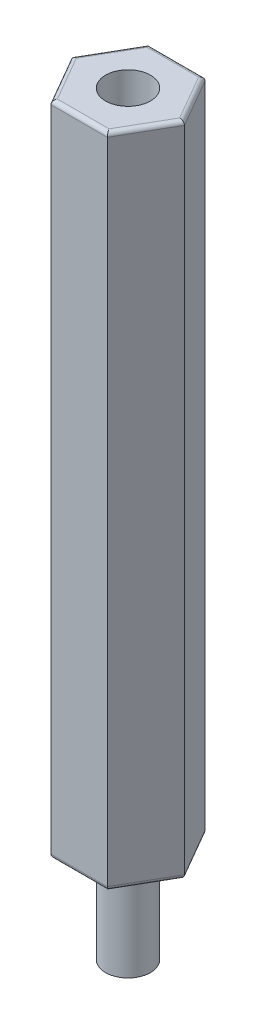
ISO-10303-21;
HEADER;
FILE_DESCRIPTION(('STEP AP214'),'2;1');
FILE_NAME('part.step','',(''),(''),'','','');
FILE_SCHEMA(('AUTOMOTIVE_DESIGN { 1 0 10303 214 1 1 1 1 }'));
ENDSEC;
DATA;
#1=APPLICATION_CONTEXT('core data for automotive mechanical design processes');
#2=APPLICATION_PROTOCOL_DEFINITION('international standard','automotive_design',2000,#1);
#3=PRODUCT_CONTEXT('',#1,'mechanical');
#4=PRODUCT('Part','Part','',(#3));
#5=PRODUCT_RELATED_PRODUCT_CATEGORY('part','',(#4));
#6=PRODUCT_DEFINITION_FORMATION('','',#4);
#7=PRODUCT_DEFINITION_CONTEXT('part definition',#1,'design');
#8=PRODUCT_DEFINITION('design','',#6,#7);
#9=PRODUCT_DEFINITION_SHAPE('','',#8);
#10=(LENGTH_UNIT() NAMED_UNIT(*) SI_UNIT(.MILLI.,.METRE.));
#11=(NAMED_UNIT(*) PLANE_ANGLE_UNIT() SI_UNIT($,.RADIAN.));
#12=(NAMED_UNIT(*) SI_UNIT($,.STERADIAN.) SOLID_ANGLE_UNIT());
#13=UNCERTAINTY_MEASURE_WITH_UNIT(LENGTH_MEASURE(1.E-05),#10,'distance_accuracy_value','');
#14=(GEOMETRIC_REPRESENTATION_CONTEXT(3) GLOBAL_UNCERTAINTY_ASSIGNED_CONTEXT((#13)) GLOBAL_UNIT_ASSIGNED_CONTEXT((#10,
#11,#12)) REPRESENTATION_CONTEXT('',''));
#15=CARTESIAN_POINT('',(0.,0.,0.));
#16=DIRECTION('',(0.,0.,1.));
#17=DIRECTION('',(1.,0.,0.));
#18=AXIS2_PLACEMENT_3D('',#15,#16,#17);
#19=CARTESIAN_POINT('',(2.74818728134262,0.,0.));
#20=DIRECTION('',(0.,1.,0.));
#21=DIRECTION('',(0.,0.,1.));
#22=AXIS2_PLACEMENT_3D('',#19,#20,#21);
#23=PLANE('',#22);
#24=DIRECTION('',(0.5,0.,-0.866025403784439));
#25=VECTOR('',#24,1.);
#26=CARTESIAN_POINT('',(2.57498220058573,0.,-0.1));
#27=LINE('',#26,#25);
#28=CARTESIAN_POINT('',(2.51724717366677,0.,0.));
#29=VERTEX_POINT('',#28);
#30=CARTESIAN_POINT('',(1.25862358683338,0.,2.18));
#31=VERTEX_POINT('',#30);
#32=EDGE_CURVE('E187',#29,#31,#27,.F.);
#33=ORIENTED_EDGE('',*,*,#32,.T.);
#34=DIRECTION('',(1.,0.,0.));
#35=VECTOR('',#34,1.);
#36=CARTESIAN_POINT('',(2.74818728134262,0.,2.18));
#37=LINE('',#36,#35);
#38=CARTESIAN_POINT('',(-1.25862358683338,0.,2.18));
#39=VERTEX_POINT('',#38);
#40=EDGE_CURVE('E40',#31,#39,#37,.F.);
#41=ORIENTED_EDGE('',*,*,#40,.T.);
#42=DIRECTION('',(0.5,0.,0.866025403784439));
#43=VECTOR('',#42,1.);
#44=CARTESIAN_POINT('',(-1.20088855991442,0.,2.28));
#45=LINE('',#44,#43);
#46=CARTESIAN_POINT('',(-2.51724717366677,0.,0.));
#47=VERTEX_POINT('',#46);
#48=EDGE_CURVE('E54',#39,#47,#45,.F.);
#49=ORIENTED_EDGE('',*,*,#48,.T.);
#50=DIRECTION('',(-0.5,0.,0.866025403784439));
#51=VECTOR('',#50,1.);
#52=CARTESIAN_POINT('',(-1.20088855991442,0.,-2.28));
#53=LINE('',#52,#51);
#54=CARTESIAN_POINT('',(-1.25862358683338,0.,-2.18));
#55=VERTEX_POINT('',#54);
#56=EDGE_CURVE('E193',#47,#55,#53,.F.);
#57=ORIENTED_EDGE('',*,*,#56,.T.);
#58=DIRECTION('',(-1.,0.,0.));
#59=VECTOR('',#58,1.);
#60=CARTESIAN_POINT('',(2.74818728134262,0.,-2.18));
#61=LINE('',#60,#59);
#62=CARTESIAN_POINT('',(1.25862358683338,0.,-2.18));
#63=VERTEX_POINT('',#62);
#64=EDGE_CURVE('E191',#55,#63,#61,.F.);
#65=ORIENTED_EDGE('',*,*,#64,.T.);
#66=DIRECTION('',(-0.5,0.,-0.866025403784438));
#67=VECTOR('',#66,1.);
#68=CARTESIAN_POINT('',(2.57498220058573,0.,0.1));
#69=LINE('',#68,#67);
#70=EDGE_CURVE('E189',#63,#29,#69,.F.);
#71=ORIENTED_EDGE('',*,*,#70,.T.);
#72=EDGE_LOOP('',(#33,#41,#49,#57,#65,#71));
#73=FACE_BOUND('',#72,.T.);
#74=CARTESIAN_POINT('',(0.,0.,0.));
#75=DIRECTION('',(0.,1.,0.));
#76=DIRECTION('',(0.,0.,1.));
#77=AXIS2_PLACEMENT_3D('',#74,#75,#76);
#78=CIRCLE('',#77,1.0922);
#79=CARTESIAN_POINT('',(0.,0.,1.0922));
#80=VERTEX_POINT('',#79);
#81=EDGE_CURVE('E11',#80,#80,#78,.F.);
#82=ORIENTED_EDGE('',*,*,#81,.F.);
#83=EDGE_LOOP('',(#82));
#84=FACE_BOUND('',#83,.T.);
#85=ADVANCED_FACE('F32',(#73,#84),#23,.F.);
#86=CARTESIAN_POINT('',(1.37409364067131,32.,2.38));
#87=DIRECTION('',(-0.866025403784439,0.,-0.5));
#88=DIRECTION('',(-0.5,0.,0.866025403784439));
#89=AXIS2_PLACEMENT_3D('',#86,#87,#88);
#90=PLANE('',#89);
#91=DIRECTION('',(0.,-1.,0.));
#92=VECTOR('',#91,1.);
#93=CARTESIAN_POINT('',(2.74818728134262,32.,0.));
#94=LINE('',#93,#92);
#95=CARTESIAN_POINT('',(2.74818728134262,31.8,0.));
#96=VERTEX_POINT('',#95);
#97=CARTESIAN_POINT('',(2.74818728134262,0.200000000000006,0.));
#98=VERTEX_POINT('',#97);
#99=EDGE_CURVE('E148',#96,#98,#94,.T.);
#100=ORIENTED_EDGE('',*,*,#99,.F.);
#101=DIRECTION('',(0.5,0.,-0.866025403784439));
#102=VECTOR('',#101,1.);
#103=CARTESIAN_POINT('',(1.37409364067131,31.8,2.38));
#104=LINE('',#103,#102);
#105=CARTESIAN_POINT('',(1.37409364067131,31.8,2.38));
#106=VERTEX_POINT('',#105);
#107=EDGE_CURVE('E139',#96,#106,#104,.F.);
#108=ORIENTED_EDGE('',*,*,#107,.T.);
#109=DIRECTION('',(0.,-1.,0.));
#110=VECTOR('',#109,1.);
#111=CARTESIAN_POINT('',(1.37409364067131,32.,2.38));
#112=LINE('',#111,#110);
#113=CARTESIAN_POINT('',(1.37409364067131,0.199999999999999,2.38));
#114=VERTEX_POINT('',#113);
#115=EDGE_CURVE('E207',#106,#114,#112,.T.);
#116=ORIENTED_EDGE('',*,*,#115,.T.);
#117=DIRECTION('',(0.5,0.,-0.866025403784439));
#118=VECTOR('',#117,1.);
#119=CARTESIAN_POINT('',(1.37409364067131,0.199999999999999,2.38));
#120=LINE('',#119,#118);
#121=EDGE_CURVE('E180',#114,#98,#120,.T.);
#122=ORIENTED_EDGE('',*,*,#121,.T.);
#123=EDGE_LOOP('',(#100,#108,#116,#122));
#124=FACE_BOUND('',#123,.T.);
#125=ADVANCED_FACE('F252',(#124),#90,.F.);
#126=CARTESIAN_POINT('',(2.74818728134262,32.,0.));
#127=DIRECTION('',(-0.866025403784439,0.,0.5));
#128=DIRECTION('',(0.5,0.,0.866025403784438));
#129=AXIS2_PLACEMENT_3D('',#126,#127,#128);
#130=PLANE('',#129);
#131=DIRECTION('',(0.,-1.,0.));
#132=VECTOR('',#131,1.);
#133=CARTESIAN_POINT('',(1.37409364067131,32.,-2.38));
#134=LINE('',#133,#132);
#135=CARTESIAN_POINT('',(1.37409364067131,31.8,-2.38));
#136=VERTEX_POINT('',#135);
#137=CARTESIAN_POINT('',(1.37409364067131,0.200000000000006,-2.38));
#138=VERTEX_POINT('',#137);
#139=EDGE_CURVE('E151',#136,#138,#134,.T.);
#140=ORIENTED_EDGE('',*,*,#139,.F.);
#141=DIRECTION('',(-0.5,0.,-0.866025403784438));
#142=VECTOR('',#141,1.);
#143=CARTESIAN_POINT('',(2.74818728134262,31.8,0.));
#144=LINE('',#143,#142);
#145=EDGE_CURVE('E185',#136,#96,#144,.F.);
#146=ORIENTED_EDGE('',*,*,#145,.T.);
#147=ORIENTED_EDGE('',*,*,#99,.T.);
#148=DIRECTION('',(-0.5,0.,-0.866025403784438));
#149=VECTOR('',#148,1.);
#150=CARTESIAN_POINT('',(2.74818728134262,0.199999999999999,0.));
#151=LINE('',#150,#149);
#152=EDGE_CURVE('E183',#98,#138,#151,.T.);
#153=ORIENTED_EDGE('',*,*,#152,.T.);
#154=EDGE_LOOP('',(#140,#146,#147,#153));
#155=FACE_BOUND('',#154,.T.);
#156=ADVANCED_FACE('F270',(#155),#130,.F.);
#157=CARTESIAN_POINT('',(1.37409364067131,32.,-2.38));
#158=DIRECTION('',(0.,0.,1.));
#159=DIRECTION('',(1.,0.,0.));
#160=AXIS2_PLACEMENT_3D('',#157,#158,#159);
#161=PLANE('',#160);
#162=DIRECTION('',(0.,-1.,0.));
#163=VECTOR('',#162,1.);
#164=CARTESIAN_POINT('',(-1.37409364067131,32.,-2.38));
#165=LINE('',#164,#163);
#166=CARTESIAN_POINT('',(-1.37409364067131,31.8,-2.38));
#167=VERTEX_POINT('',#166);
#168=CARTESIAN_POINT('',(-1.37409364067131,0.200000000000006,-2.38));
#169=VERTEX_POINT('',#168);
#170=EDGE_CURVE('E261',#167,#169,#165,.T.);
#171=ORIENTED_EDGE('',*,*,#170,.F.);
#172=DIRECTION('',(-1.,0.,0.));
#173=VECTOR('',#172,1.);
#174=CARTESIAN_POINT('',(1.37409364067131,31.8,-2.38));
#175=LINE('',#174,#173);
#176=EDGE_CURVE('E164',#167,#136,#175,.F.);
#177=ORIENTED_EDGE('',*,*,#176,.T.);
#178=ORIENTED_EDGE('',*,*,#139,.T.);
#179=DIRECTION('',(-1.,0.,0.));
#180=VECTOR('',#179,1.);
#181=CARTESIAN_POINT('',(1.37409364067131,0.199999999999999,-2.38));
#182=LINE('',#181,#180);
#183=EDGE_CURVE('E162',#138,#169,#182,.T.);
#184=ORIENTED_EDGE('',*,*,#183,.T.);
#185=EDGE_LOOP('',(#171,#177,#178,#184));
#186=FACE_BOUND('',#185,.T.);
#187=ADVANCED_FACE('F267',(#186),#161,.F.);
#188=CARTESIAN_POINT('',(-1.37409364067131,32.,-2.38));
#189=DIRECTION('',(0.866025403784439,0.,0.5));
#190=DIRECTION('',(0.5,0.,-0.866025403784439));
#191=AXIS2_PLACEMENT_3D('',#188,#189,#190);
#192=PLANE('',#191);
#193=DIRECTION('',(0.,-1.,0.));
#194=VECTOR('',#193,1.);
#195=CARTESIAN_POINT('',(-2.74818728134262,32.,0.));
#196=LINE('',#195,#194);
#197=CARTESIAN_POINT('',(-2.74818728134262,31.8,0.));
#198=VERTEX_POINT('',#197);
#199=CARTESIAN_POINT('',(-2.74818728134262,0.200000000000006,0.));
#200=VERTEX_POINT('',#199);
#201=EDGE_CURVE('E254',#198,#200,#196,.T.);
#202=ORIENTED_EDGE('',*,*,#201,.F.);
#203=DIRECTION('',(-0.5,0.,0.866025403784439));
#204=VECTOR('',#203,1.);
#205=CARTESIAN_POINT('',(-1.37409364067131,31.8,-2.38));
#206=LINE('',#205,#204);
#207=EDGE_CURVE('E169',#198,#167,#206,.F.);
#208=ORIENTED_EDGE('',*,*,#207,.T.);
#209=ORIENTED_EDGE('',*,*,#170,.T.);
#210=DIRECTION('',(-0.5,0.,0.866025403784439));
#211=VECTOR('',#210,1.);
#212=CARTESIAN_POINT('',(-1.37409364067131,0.199999999999999,-2.38));
#213=LINE('',#212,#211);
#214=EDGE_CURVE('E167',#169,#200,#213,.T.);
#215=ORIENTED_EDGE('',*,*,#214,.T.);
#216=EDGE_LOOP('',(#202,#208,#209,#215));
#217=FACE_BOUND('',#216,.T.);
#218=ADVANCED_FACE('F277',(#217),#192,.F.);
#219=CARTESIAN_POINT('',(-2.74818728134262,32.,0.));
#220=DIRECTION('',(0.866025403784439,0.,-0.5));
#221=DIRECTION('',(-0.5,0.,-0.866025403784439));
#222=AXIS2_PLACEMENT_3D('',#219,#220,#221);
#223=PLANE('',#222);
#224=DIRECTION('',(0.,-1.,0.));
#225=VECTOR('',#224,1.);
#226=CARTESIAN_POINT('',(-1.37409364067131,32.,2.38));
#227=LINE('',#226,#225);
#228=CARTESIAN_POINT('',(-1.37409364067131,31.8,2.38));
#229=VERTEX_POINT('',#228);
#230=CARTESIAN_POINT('',(-1.37409364067131,0.200000000000006,2.38));
#231=VERTEX_POINT('',#230);
#232=EDGE_CURVE('E249',#229,#231,#227,.T.);
#233=ORIENTED_EDGE('',*,*,#232,.F.);
#234=DIRECTION('',(0.5,0.,0.866025403784439));
#235=VECTOR('',#234,1.);
#236=CARTESIAN_POINT('',(-2.74818728134262,31.8,0.));
#237=LINE('',#236,#235);
#238=EDGE_CURVE('E173',#229,#198,#237,.F.);
#239=ORIENTED_EDGE('',*,*,#238,.T.);
#240=ORIENTED_EDGE('',*,*,#201,.T.);
#241=DIRECTION('',(0.5,0.,0.866025403784439));
#242=VECTOR('',#241,1.);
#243=CARTESIAN_POINT('',(-2.74818728134262,0.199999999999999,0.));
#244=LINE('',#243,#242);
#245=EDGE_CURVE('E171',#200,#231,#244,.T.);
#246=ORIENTED_EDGE('',*,*,#245,.T.);
#247=EDGE_LOOP('',(#233,#239,#240,#246));
#248=FACE_BOUND('',#247,.T.);
#249=ADVANCED_FACE('F289',(#248),#223,.F.);
#250=CARTESIAN_POINT('',(-1.37409364067131,32.,2.38));
#251=DIRECTION('',(0.,0.,-1.));
#252=DIRECTION('',(-1.,0.,0.));
#253=AXIS2_PLACEMENT_3D('',#250,#251,#252);
#254=PLANE('',#253);
#255=ORIENTED_EDGE('',*,*,#115,.F.);
#256=DIRECTION('',(1.,0.,0.));
#257=VECTOR('',#256,1.);
#258=CARTESIAN_POINT('',(-1.37409364067131,31.8,2.38));
#259=LINE('',#258,#257);
#260=EDGE_CURVE('E178',#106,#229,#259,.F.);
#261=ORIENTED_EDGE('',*,*,#260,.T.);
#262=ORIENTED_EDGE('',*,*,#232,.T.);
#263=DIRECTION('',(1.,0.,0.));
#264=VECTOR('',#263,1.);
#265=CARTESIAN_POINT('',(-1.37409364067131,0.199999999999999,2.38));
#266=LINE('',#265,#264);
#267=EDGE_CURVE('E175',#231,#114,#266,.T.);
#268=ORIENTED_EDGE('',*,*,#267,.T.);
#269=EDGE_LOOP('',(#255,#261,#262,#268));
#270=FACE_BOUND('',#269,.T.);
#271=ADVANCED_FACE('F246',(#270),#254,.F.);
#272=CARTESIAN_POINT('',(2.74818728134262,32.,0.));
#273=DIRECTION('',(0.,1.,0.));
#274=DIRECTION('',(0.,0.,1.));
#275=AXIS2_PLACEMENT_3D('',#272,#273,#274);
#276=PLANE('',#275);
#277=CARTESIAN_POINT('',(0.,32.,0.));
#278=DIRECTION('',(0.,1.,0.));
#279=DIRECTION('',(0.,0.,1.));
#280=AXIS2_PLACEMENT_3D('',#277,#278,#279);
#281=CIRCLE('',#280,1.0922);
#282=CARTESIAN_POINT('',(0.,32.,1.0922));
#283=VERTEX_POINT('',#282);
#284=EDGE_CURVE('E372',#283,#283,#281,.T.);
#285=ORIENTED_EDGE('',*,*,#284,.F.);
#286=EDGE_LOOP('',(#285));
#287=FACE_BOUND('',#286,.T.);
#288=DIRECTION('',(-0.5,0.,-0.866025403784438));
#289=VECTOR('',#288,1.);
#290=CARTESIAN_POINT('',(1.20088855991442,32.,-2.28));
#291=LINE('',#290,#289);
#292=CARTESIAN_POINT('',(2.51724717366677,32.,0.));
#293=VERTEX_POINT('',#292);
#294=CARTESIAN_POINT('',(1.25862358683338,32.,-2.18));
#295=VERTEX_POINT('',#294);
#296=EDGE_CURVE('E127',#293,#295,#291,.T.);
#297=ORIENTED_EDGE('',*,*,#296,.T.);
#298=DIRECTION('',(-1.,0.,0.));
#299=VECTOR('',#298,1.);
#300=CARTESIAN_POINT('',(-1.37409364067131,32.,-2.18));
#301=LINE('',#300,#299);
#302=CARTESIAN_POINT('',(-1.25862358683338,32.,-2.18));
#303=VERTEX_POINT('',#302);
#304=EDGE_CURVE('E160',#295,#303,#301,.T.);
#305=ORIENTED_EDGE('',*,*,#304,.T.);
#306=DIRECTION('',(-0.5,0.,0.866025403784439));
#307=VECTOR('',#306,1.);
#308=CARTESIAN_POINT('',(-2.57498220058573,32.,0.100000000000002));
#309=LINE('',#308,#307);
#310=CARTESIAN_POINT('',(-2.51724717366677,32.,0.));
#311=VERTEX_POINT('',#310);
#312=EDGE_CURVE('E158',#303,#311,#309,.T.);
#313=ORIENTED_EDGE('',*,*,#312,.T.);
#314=DIRECTION('',(0.5,0.,0.866025403784439));
#315=VECTOR('',#314,1.);
#316=CARTESIAN_POINT('',(-1.20088855991442,32.,2.28));
#317=LINE('',#316,#315);
#318=CARTESIAN_POINT('',(-1.25862358683338,32.,2.18));
#319=VERTEX_POINT('',#318);
#320=EDGE_CURVE('E156',#311,#319,#317,.T.);
#321=ORIENTED_EDGE('',*,*,#320,.T.);
#322=DIRECTION('',(1.,0.,0.));
#323=VECTOR('',#322,1.);
#324=CARTESIAN_POINT('',(1.37409364067131,32.,2.18));
#325=LINE('',#324,#323);
#326=CARTESIAN_POINT('',(1.25862358683338,32.,2.18));
#327=VERTEX_POINT('',#326);
#328=EDGE_CURVE('E130',#319,#327,#325,.T.);
#329=ORIENTED_EDGE('',*,*,#328,.T.);
#330=DIRECTION('',(0.5,0.,-0.866025403784439));
#331=VECTOR('',#330,1.);
#332=CARTESIAN_POINT('',(2.57498220058573,32.,-0.1));
#333=LINE('',#332,#331);
#334=EDGE_CURVE('E122',#327,#293,#333,.T.);
#335=ORIENTED_EDGE('',*,*,#334,.T.);
#336=EDGE_LOOP('',(#297,#305,#313,#321,#329,#335));
#337=FACE_BOUND('',#336,.T.);
#338=ADVANCED_FACE('F124',(#287,#337),#276,.T.);
#339=CARTESIAN_POINT('',(2.74818728134262,31.8,2.18));
#340=DIRECTION('',(-1.,0.,0.));
#341=DIRECTION('',(0.,0.,1.));
#342=AXIS2_PLACEMENT_3D('',#339,#340,#341);
#343=CYLINDRICAL_SURFACE('',#342,0.2);
#344=CARTESIAN_POINT('',(-1.25862358683338,31.8,2.18));
#345=DIRECTION('',(-0.866025403784439,0.,-0.5));
#346=DIRECTION('',(-0.5,0.,0.866025403784439));
#347=AXIS2_PLACEMENT_3D('',#344,#345,#346);
#348=ELLIPSE('',#347,0.23094010767585,0.2);
#349=EDGE_CURVE('E142',#229,#319,#348,.T.);
#350=ORIENTED_EDGE('',*,*,#349,.F.);
#351=ORIENTED_EDGE('',*,*,#260,.F.);
#352=CARTESIAN_POINT('',(1.25862358683338,31.8,2.18));
#353=DIRECTION('',(-0.866025403784438,0.,0.5));
#354=DIRECTION('',(0.5,0.,0.866025403784439));
#355=AXIS2_PLACEMENT_3D('',#352,#353,#354);
#356=ELLIPSE('',#355,0.23094010767585,0.2);
#357=EDGE_CURVE('E205',#327,#106,#356,.F.);
#358=ORIENTED_EDGE('',*,*,#357,.F.);
#359=ORIENTED_EDGE('',*,*,#328,.F.);
#360=EDGE_LOOP('',(#350,#351,#358,#359));
#361=FACE_BOUND('',#360,.T.);
#362=ADVANCED_FACE('F312',(#361),#343,.T.);
#363=CARTESIAN_POINT('',(2.57498220058573,31.8,-0.1));
#364=DIRECTION('',(-0.5,0.,0.866025403784439));
#365=DIRECTION('',(0.866025403784439,0.,0.5));
#366=AXIS2_PLACEMENT_3D('',#363,#364,#365);
#367=CYLINDRICAL_SURFACE('',#366,0.2);
#368=ORIENTED_EDGE('',*,*,#357,.T.);
#369=ORIENTED_EDGE('',*,*,#107,.F.);
#370=CARTESIAN_POINT('',(2.51724717366677,31.8,0.));
#371=DIRECTION('',(0.,0.,1.));
#372=DIRECTION('',(1.,0.,0.));
#373=AXIS2_PLACEMENT_3D('',#370,#371,#372);
#374=ELLIPSE('',#373,0.23094010767585,0.2);
#375=EDGE_CURVE('E137',#293,#96,#374,.F.);
#376=ORIENTED_EDGE('',*,*,#375,.F.);
#377=ORIENTED_EDGE('',*,*,#334,.F.);
#378=EDGE_LOOP('',(#368,#369,#376,#377));
#379=FACE_BOUND('',#378,.T.);
#380=ADVANCED_FACE('F138',(#379),#367,.T.);
#381=CARTESIAN_POINT('',(-1.20088855991442,31.8,2.28));
#382=DIRECTION('',(-0.5,0.,-0.866025403784439));
#383=DIRECTION('',(-0.866025403784439,0.,0.5));
#384=AXIS2_PLACEMENT_3D('',#381,#382,#383);
#385=CYLINDRICAL_SURFACE('',#384,0.2);
#386=ORIENTED_EDGE('',*,*,#349,.T.);
#387=ORIENTED_EDGE('',*,*,#320,.F.);
#388=CARTESIAN_POINT('',(-2.51724717366677,31.8,0.));
#389=DIRECTION('',(0.,0.,-1.));
#390=DIRECTION('',(-1.,0.,0.));
#391=AXIS2_PLACEMENT_3D('',#388,#389,#390);
#392=ELLIPSE('',#391,0.23094010767585,0.2);
#393=EDGE_CURVE('E143',#198,#311,#392,.T.);
#394=ORIENTED_EDGE('',*,*,#393,.F.);
#395=ORIENTED_EDGE('',*,*,#238,.F.);
#396=EDGE_LOOP('',(#386,#387,#394,#395));
#397=FACE_BOUND('',#396,.T.);
#398=ADVANCED_FACE('F303',(#397),#385,.T.);
#399=CARTESIAN_POINT('',(2.57498220058573,31.8,0.1));
#400=DIRECTION('',(0.5,0.,0.866025403784438));
#401=DIRECTION('',(0.866025403784439,0.,-0.5));
#402=AXIS2_PLACEMENT_3D('',#399,#400,#401);
#403=CYLINDRICAL_SURFACE('',#402,0.2);
#404=ORIENTED_EDGE('',*,*,#375,.T.);
#405=ORIENTED_EDGE('',*,*,#145,.F.);
#406=CARTESIAN_POINT('',(1.25862358683338,31.8,-2.18));
#407=DIRECTION('',(0.866025403784439,0.,0.5));
#408=DIRECTION('',(-0.5,0.,0.866025403784439));
#409=AXIS2_PLACEMENT_3D('',#406,#407,#408);
#410=ELLIPSE('',#409,0.23094010767585,0.2);
#411=EDGE_CURVE('E146',#295,#136,#410,.F.);
#412=ORIENTED_EDGE('',*,*,#411,.F.);
#413=ORIENTED_EDGE('',*,*,#296,.F.);
#414=EDGE_LOOP('',(#404,#405,#412,#413));
#415=FACE_BOUND('',#414,.T.);
#416=ADVANCED_FACE('F145',(#415),#403,.T.);
#417=CARTESIAN_POINT('',(-1.20088855991442,31.8,-2.28));
#418=DIRECTION('',(0.5,0.,-0.866025403784439));
#419=DIRECTION('',(-0.866025403784439,0.,-0.5));
#420=AXIS2_PLACEMENT_3D('',#417,#418,#419);
#421=CYLINDRICAL_SURFACE('',#420,0.2);
#422=ORIENTED_EDGE('',*,*,#393,.T.);
#423=ORIENTED_EDGE('',*,*,#312,.F.);
#424=CARTESIAN_POINT('',(-1.25862358683338,31.8,-2.18));
#425=DIRECTION('',(0.866025403784439,0.,-0.5));
#426=DIRECTION('',(-0.5,0.,-0.866025403784439));
#427=AXIS2_PLACEMENT_3D('',#424,#425,#426);
#428=ELLIPSE('',#427,0.23094010767585,0.2);
#429=EDGE_CURVE('E197',#167,#303,#428,.T.);
#430=ORIENTED_EDGE('',*,*,#429,.F.);
#431=ORIENTED_EDGE('',*,*,#207,.F.);
#432=EDGE_LOOP('',(#422,#423,#430,#431));
#433=FACE_BOUND('',#432,.T.);
#434=ADVANCED_FACE('F307',(#433),#421,.T.);
#435=CARTESIAN_POINT('',(2.74818728134262,31.8,-2.18));
#436=DIRECTION('',(1.,0.,0.));
#437=DIRECTION('',(0.,0.,-1.));
#438=AXIS2_PLACEMENT_3D('',#435,#436,#437);
#439=CYLINDRICAL_SURFACE('',#438,0.2);
#440=ORIENTED_EDGE('',*,*,#411,.T.);
#441=ORIENTED_EDGE('',*,*,#176,.F.);
#442=ORIENTED_EDGE('',*,*,#429,.T.);
#443=ORIENTED_EDGE('',*,*,#304,.F.);
#444=EDGE_LOOP('',(#440,#441,#442,#443));
#445=FACE_BOUND('',#444,.T.);
#446=ADVANCED_FACE('F309',(#445),#439,.T.);
#447=CARTESIAN_POINT('',(1.37409364067131,0.199999999999999,-2.18));
#448=DIRECTION('',(-1.,0.,0.));
#449=DIRECTION('',(0.,0.,1.));
#450=AXIS2_PLACEMENT_3D('',#447,#448,#449);
#451=CYLINDRICAL_SURFACE('',#450,0.2);
#452=CARTESIAN_POINT('',(1.25862358683338,0.199999999999999,-2.18));
#453=DIRECTION('',(-0.866025403784439,0.,-0.5));
#454=DIRECTION('',(0.5,0.,-0.866025403784439));
#455=AXIS2_PLACEMENT_3D('',#452,#453,#454);
#456=ELLIPSE('',#455,0.23094010767585,0.2);
#457=EDGE_CURVE('E218',#63,#138,#456,.F.);
#458=ORIENTED_EDGE('',*,*,#457,.F.);
#459=ORIENTED_EDGE('',*,*,#64,.F.);
#460=CARTESIAN_POINT('',(-1.25862358683338,0.199999999999999,-2.18));
#461=DIRECTION('',(-0.866025403784439,0.,0.5));
#462=DIRECTION('',(-0.5,0.,-0.866025403784439));
#463=AXIS2_PLACEMENT_3D('',#460,#461,#462);
#464=ELLIPSE('',#463,0.23094010767585,0.2);
#465=EDGE_CURVE('E199',#169,#55,#464,.T.);
#466=ORIENTED_EDGE('',*,*,#465,.F.);
#467=ORIENTED_EDGE('',*,*,#183,.F.);
#468=EDGE_LOOP('',(#458,#459,#466,#467));
#469=FACE_BOUND('',#468,.T.);
#470=ADVANCED_FACE('F34',(#469),#451,.T.);
#471=CARTESIAN_POINT('',(-1.20088855991442,0.199999999999999,-2.28));
#472=DIRECTION('',(-0.5,0.,0.866025403784439));
#473=DIRECTION('',(0.866025403784439,0.,0.5));
#474=AXIS2_PLACEMENT_3D('',#471,#472,#473);
#475=CYLINDRICAL_SURFACE('',#474,0.2);
#476=ORIENTED_EDGE('',*,*,#465,.T.);
#477=ORIENTED_EDGE('',*,*,#56,.F.);
#478=CARTESIAN_POINT('',(-2.51724717366677,0.199999999999999,0.));
#479=DIRECTION('',(0.,0.,1.));
#480=DIRECTION('',(-1.,0.,0.));
#481=AXIS2_PLACEMENT_3D('',#478,#479,#480);
#482=ELLIPSE('',#481,0.23094010767585,0.2);
#483=EDGE_CURVE('E215',#200,#47,#482,.T.);
#484=ORIENTED_EDGE('',*,*,#483,.F.);
#485=ORIENTED_EDGE('',*,*,#214,.F.);
#486=EDGE_LOOP('',(#476,#477,#484,#485));
#487=FACE_BOUND('',#486,.T.);
#488=ADVANCED_FACE('F224',(#487),#475,.T.);
#489=CARTESIAN_POINT('',(2.57498220058573,0.199999999999999,0.1));
#490=DIRECTION('',(-0.5,0.,-0.866025403784438));
#491=DIRECTION('',(-0.866025403784439,0.,0.5));
#492=AXIS2_PLACEMENT_3D('',#489,#490,#491);
#493=CYLINDRICAL_SURFACE('',#492,0.2);
#494=ORIENTED_EDGE('',*,*,#457,.T.);
#495=ORIENTED_EDGE('',*,*,#152,.F.);
#496=CARTESIAN_POINT('',(2.51724717366677,0.199999999999999,0.));
#497=DIRECTION('',(0.,0.,-1.));
#498=DIRECTION('',(1.,0.,0.));
#499=AXIS2_PLACEMENT_3D('',#496,#497,#498);
#500=ELLIPSE('',#499,0.23094010767585,0.2);
#501=EDGE_CURVE('E212',#29,#98,#500,.F.);
#502=ORIENTED_EDGE('',*,*,#501,.F.);
#503=ORIENTED_EDGE('',*,*,#70,.F.);
#504=EDGE_LOOP('',(#494,#495,#502,#503));
#505=FACE_BOUND('',#504,.T.);
#506=ADVANCED_FACE('F236',(#505),#493,.T.);
#507=CARTESIAN_POINT('',(-2.57498220058573,0.199999999999999,-0.0999999999999992));
#508=DIRECTION('',(0.5,0.,0.866025403784439));
#509=DIRECTION('',(0.866025403784439,0.,-0.5));
#510=AXIS2_PLACEMENT_3D('',#507,#508,#509);
#511=CYLINDRICAL_SURFACE('',#510,0.2);
#512=ORIENTED_EDGE('',*,*,#483,.T.);
#513=ORIENTED_EDGE('',*,*,#48,.F.);
#514=CARTESIAN_POINT('',(-1.25862358683338,0.199999999999999,2.18));
#515=DIRECTION('',(0.866025403784439,0.,0.5));
#516=DIRECTION('',(-0.5,0.,0.866025403784439));
#517=AXIS2_PLACEMENT_3D('',#514,#515,#516);
#518=ELLIPSE('',#517,0.23094010767585,0.2);
#519=EDGE_CURVE('E47',#231,#39,#518,.T.);
#520=ORIENTED_EDGE('',*,*,#519,.F.);
#521=ORIENTED_EDGE('',*,*,#245,.F.);
#522=EDGE_LOOP('',(#512,#513,#520,#521));
#523=FACE_BOUND('',#522,.T.);
#524=ADVANCED_FACE('F315',(#523),#511,.T.);
#525=CARTESIAN_POINT('',(1.20088855991442,0.199999999999999,2.28));
#526=DIRECTION('',(0.5,0.,-0.866025403784439));
#527=DIRECTION('',(-0.866025403784439,0.,-0.5));
#528=AXIS2_PLACEMENT_3D('',#525,#526,#527);
#529=CYLINDRICAL_SURFACE('',#528,0.2);
#530=ORIENTED_EDGE('',*,*,#501,.T.);
#531=ORIENTED_EDGE('',*,*,#121,.F.);
#532=CARTESIAN_POINT('',(1.25862358683338,0.199999999999999,2.18));
#533=DIRECTION('',(0.866025403784438,0.,-0.5));
#534=DIRECTION('',(-0.5,0.,-0.866025403784439));
#535=AXIS2_PLACEMENT_3D('',#532,#533,#534);
#536=ELLIPSE('',#535,0.23094010767585,0.2);
#537=EDGE_CURVE('E208',#31,#114,#536,.F.);
#538=ORIENTED_EDGE('',*,*,#537,.F.);
#539=ORIENTED_EDGE('',*,*,#32,.F.);
#540=EDGE_LOOP('',(#530,#531,#538,#539));
#541=FACE_BOUND('',#540,.T.);
#542=ADVANCED_FACE('F240',(#541),#529,.T.);
#543=CARTESIAN_POINT('',(-1.37409364067131,0.199999999999999,2.18));
#544=DIRECTION('',(1.,0.,0.));
#545=DIRECTION('',(0.,0.,-1.));
#546=AXIS2_PLACEMENT_3D('',#543,#544,#545);
#547=CYLINDRICAL_SURFACE('',#546,0.2);
#548=ORIENTED_EDGE('',*,*,#519,.T.);
#549=ORIENTED_EDGE('',*,*,#40,.F.);
#550=ORIENTED_EDGE('',*,*,#537,.T.);
#551=ORIENTED_EDGE('',*,*,#267,.F.);
#552=EDGE_LOOP('',(#548,#549,#550,#551));
#553=FACE_BOUND('',#552,.T.);
#554=ADVANCED_FACE('F241',(#553),#547,.T.);
#555=CARTESIAN_POINT('',(0.,-4.76,0.));
#556=DIRECTION('',(0.,1.,0.));
#557=DIRECTION('',(0.,0.,1.));
#558=AXIS2_PLACEMENT_3D('',#555,#556,#557);
#559=CYLINDRICAL_SURFACE('',#558,1.0922);
#560=CARTESIAN_POINT('',(0.,-4.76,0.));
#561=DIRECTION('',(0.,-1.,0.));
#562=DIRECTION('',(0.,0.,-1.));
#563=AXIS2_PLACEMENT_3D('',#560,#561,#562);
#564=CIRCLE('',#563,1.0922);
#565=CARTESIAN_POINT('',(0.,-4.76,-1.0922));
#566=VERTEX_POINT('',#565);
#567=EDGE_CURVE('E210',#566,#566,#564,.T.);
#568=ORIENTED_EDGE('',*,*,#567,.F.);
#569=EDGE_LOOP('',(#568));
#570=FACE_BOUND('',#569,.T.);
#571=ORIENTED_EDGE('',*,*,#81,.T.);
#572=EDGE_LOOP('',(#571));
#573=FACE_BOUND('',#572,.T.);
#574=ADVANCED_FACE('F346',(#570,#573),#559,.T.);
#575=CARTESIAN_POINT('',(0.,-4.76,0.));
#576=DIRECTION('',(0.,-1.,0.));
#577=DIRECTION('',(0.,0.,-1.));
#578=AXIS2_PLACEMENT_3D('',#575,#576,#577);
#579=PLANE('',#578);
#580=ORIENTED_EDGE('',*,*,#567,.T.);
#581=EDGE_LOOP('',(#580));
#582=FACE_BOUND('',#581,.T.);
#583=ADVANCED_FACE('F350',(#582),#579,.T.);
#584=CARTESIAN_POINT('',(0.,27.24,0.));
#585=DIRECTION('',(0.,1.,0.));
#586=DIRECTION('',(0.,0.,1.));
#587=AXIS2_PLACEMENT_3D('',#584,#585,#586);
#588=CYLINDRICAL_SURFACE('',#587,1.0922);
#589=CARTESIAN_POINT('',(0.,27.24,0.));
#590=DIRECTION('',(0.,1.,0.));
#591=DIRECTION('',(0.,0.,1.));
#592=AXIS2_PLACEMENT_3D('',#589,#590,#591);
#593=CIRCLE('',#592,1.0922);
#594=CARTESIAN_POINT('',(0.,27.24,1.0922));
#595=VERTEX_POINT('',#594);
#596=EDGE_CURVE('E371',#595,#595,#593,.T.);
#597=ORIENTED_EDGE('',*,*,#596,.F.);
#598=EDGE_LOOP('',(#597));
#599=FACE_BOUND('',#598,.T.);
#600=ORIENTED_EDGE('',*,*,#284,.T.);
#601=EDGE_LOOP('',(#600));
#602=FACE_BOUND('',#601,.T.);
#603=ADVANCED_FACE('F355',(#599,#602),#588,.F.);
#604=CARTESIAN_POINT('',(0.,27.24,0.));
#605=DIRECTION('',(0.,1.,0.));
#606=DIRECTION('',(0.,0.,1.));
#607=AXIS2_PLACEMENT_3D('',#604,#605,#606);
#608=PLANE('',#607);
#609=ORIENTED_EDGE('',*,*,#596,.T.);
#610=EDGE_LOOP('',(#609));
#611=FACE_BOUND('',#610,.T.);
#612=ADVANCED_FACE('F363',(#611),#608,.T.);
#613=CLOSED_SHELL('',(#85,#125,#156,#187,#218,#249,#271,#338,#362,#380,#398,#416,#434,#446,#470,
#488,#506,#524,#542,#554,#574,#583,#603,#612));
#614=MANIFOLD_SOLID_BREP('B2',#613);
#615=ADVANCED_BREP_SHAPE_REPRESENTATION('',(#18,#614),#14);
#616=SHAPE_DEFINITION_REPRESENTATION(#9,#615);
ENDSEC;
END-ISO-10303-21;
